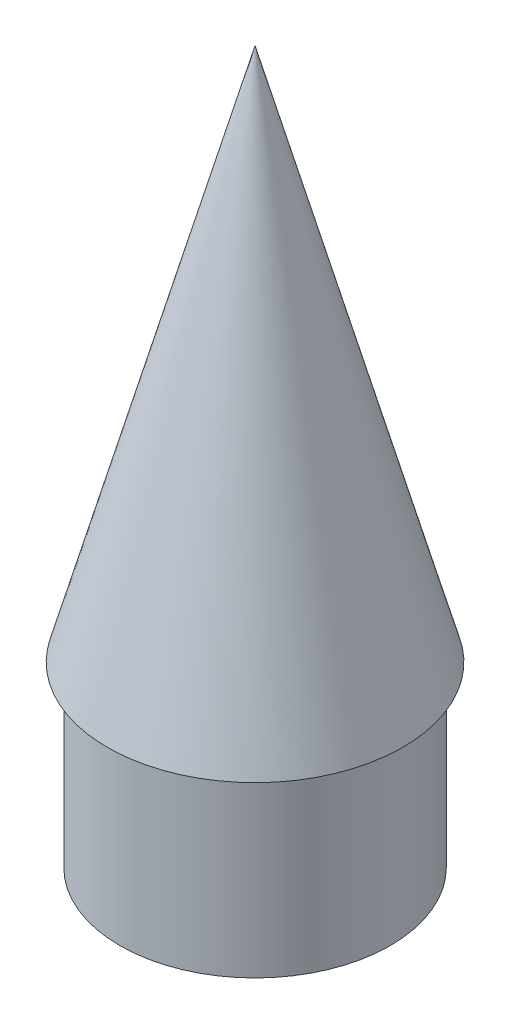
ISO-10303-21;
HEADER;
FILE_DESCRIPTION(('STEP AP214'),'2;1');
FILE_NAME('part.step','',(''),(''),'','','');
FILE_SCHEMA(('AUTOMOTIVE_DESIGN { 1 0 10303 214 1 1 1 1 }'));
ENDSEC;
DATA;
#1=APPLICATION_CONTEXT('core data for automotive mechanical design processes');
#2=APPLICATION_PROTOCOL_DEFINITION('international standard','automotive_design',2000,#1);
#3=PRODUCT_CONTEXT('',#1,'mechanical');
#4=PRODUCT('Part','Part','',(#3));
#5=PRODUCT_RELATED_PRODUCT_CATEGORY('part','',(#4));
#6=PRODUCT_DEFINITION_FORMATION('','',#4);
#7=PRODUCT_DEFINITION_CONTEXT('part definition',#1,'design');
#8=PRODUCT_DEFINITION('design','',#6,#7);
#9=PRODUCT_DEFINITION_SHAPE('','',#8);
#10=(LENGTH_UNIT() NAMED_UNIT(*) SI_UNIT(.MILLI.,.METRE.));
#11=(NAMED_UNIT(*) PLANE_ANGLE_UNIT() SI_UNIT($,.RADIAN.));
#12=(NAMED_UNIT(*) SI_UNIT($,.STERADIAN.) SOLID_ANGLE_UNIT());
#13=UNCERTAINTY_MEASURE_WITH_UNIT(LENGTH_MEASURE(1.E-05),#10,'distance_accuracy_value','');
#14=(GEOMETRIC_REPRESENTATION_CONTEXT(3) GLOBAL_UNCERTAINTY_ASSIGNED_CONTEXT((#13)) GLOBAL_UNIT_ASSIGNED_CONTEXT((#10,
#11,#12)) REPRESENTATION_CONTEXT('',''));
#15=CARTESIAN_POINT('',(0.,0.,0.));
#16=DIRECTION('',(0.,0.,1.));
#17=DIRECTION('',(1.,0.,0.));
#18=AXIS2_PLACEMENT_3D('',#15,#16,#17);
#19=CARTESIAN_POINT('',(0.,150.,0.));
#20=DIRECTION('',(0.,-1.,0.));
#21=DIRECTION('',(0.,0.,-1.));
#22=AXIS2_PLACEMENT_3D('',#19,#20,#21);
#23=CONICAL_SURFACE('',#22,0.,0.26991503643116);
#24=CARTESIAN_POINT('',(0.,0.,0.));
#25=DIRECTION('',(0.,-1.,0.));
#26=DIRECTION('',(0.,0.,-1.));
#27=AXIS2_PLACEMENT_3D('',#24,#25,#26);
#28=CIRCLE('',#27,41.5);
#29=CARTESIAN_POINT('',(0.,0.,-41.5));
#30=VERTEX_POINT('',#29);
#31=EDGE_CURVE('E106',#30,#30,#28,.T.);
#32=CARTESIAN_POINT('',(0.,149.9,0.));
#33=DIRECTION('',(0.,1.,0.));
#34=DIRECTION('',(0.,0.,1.));
#35=AXIS2_PLACEMENT_3D('',#32,#33,#34);
#36=CIRCLE('',#35,0.0276666666666713);
#37=CARTESIAN_POINT('',(0.,149.9,-0.0276666666666751));
#38=VERTEX_POINT('',#37);
#39=EDGE_CURVE('E54',#38,#38,#36,.T.);
#40=CARTESIAN_POINT('',(0.,0.,-41.5));
#41=CARTESIAN_POINT('',(0.,1.56145833333333,-41.0679965277778));
#42=CARTESIAN_POINT('',(0.,3.12291666666666,-40.6359930555556));
#43=CARTESIAN_POINT('',(0.,6.24583333333333,-39.7719861111111));
#44=CARTESIAN_POINT('',(0.,7.80729166666667,-39.3399826388889));
#45=CARTESIAN_POINT('',(0.,10.9302083333333,-38.4759756944444));
#46=CARTESIAN_POINT('',(0.,12.4916666666667,-38.0439722222222));
#47=CARTESIAN_POINT('',(0.,15.6145833333333,-37.1799652777778));
#48=CARTESIAN_POINT('',(0.,17.1760416666667,-36.7479618055556));
#49=CARTESIAN_POINT('',(0.,20.2989583333333,-35.8839548611111));
#50=CARTESIAN_POINT('',(0.,21.8604166666666,-35.4519513888889));
#51=CARTESIAN_POINT('',(0.,24.9833333333333,-34.5879444444444));
#52=CARTESIAN_POINT('',(0.,26.5447916666667,-34.1559409722222));
#53=CARTESIAN_POINT('',(0.,29.6677083333333,-33.2919340277778));
#54=CARTESIAN_POINT('',(0.,31.2291666666667,-32.8599305555556));
#55=CARTESIAN_POINT('',(0.,34.3520833333333,-31.9959236111111));
#56=CARTESIAN_POINT('',(0.,35.9135416666667,-31.5639201388889));
#57=CARTESIAN_POINT('',(0.,39.0364583333333,-30.6999131944444));
#58=CARTESIAN_POINT('',(0.,40.5979166666667,-30.2679097222222));
#59=CARTESIAN_POINT('',(0.,43.7208333333333,-29.4039027777778));
#60=CARTESIAN_POINT('',(0.,45.2822916666667,-28.9718993055556));
#61=CARTESIAN_POINT('',(0.,48.4052083333333,-28.1078923611111));
#62=CARTESIAN_POINT('',(0.,49.9666666666667,-27.6758888888889));
#63=CARTESIAN_POINT('',(0.,53.0895833333333,-26.8118819444444));
#64=CARTESIAN_POINT('',(0.,54.6510416666667,-26.3798784722222));
#65=CARTESIAN_POINT('',(0.,57.7739583333333,-25.5158715277778));
#66=CARTESIAN_POINT('',(0.,59.3354166666667,-25.0838680555556));
#67=CARTESIAN_POINT('',(0.,62.4583333333333,-24.2198611111111));
#68=CARTESIAN_POINT('',(0.,64.0197916666667,-23.7878576388889));
#69=CARTESIAN_POINT('',(0.,67.1427083333333,-22.9238506944445));
#70=CARTESIAN_POINT('',(0.,68.7041666666667,-22.4918472222222));
#71=CARTESIAN_POINT('',(0.,71.8270833333333,-21.6278402777778));
#72=CARTESIAN_POINT('',(0.,73.3885416666667,-21.1958368055556));
#73=CARTESIAN_POINT('',(0.,76.5114583333333,-20.3318298611111));
#74=CARTESIAN_POINT('',(0.,78.0729166666667,-19.8998263888889));
#75=CARTESIAN_POINT('',(0.,81.1958333333333,-19.0358194444444));
#76=CARTESIAN_POINT('',(0.,82.7572916666666,-18.6038159722222));
#77=CARTESIAN_POINT('',(0.,85.8802083333333,-17.7398090277778));
#78=CARTESIAN_POINT('',(0.,87.4416666666666,-17.3078055555556));
#79=CARTESIAN_POINT('',(0.,90.5645833333333,-16.4437986111111));
#80=CARTESIAN_POINT('',(0.,92.1260416666666,-16.0117951388889));
#81=CARTESIAN_POINT('',(0.,95.2489583333333,-15.1477881944445));
#82=CARTESIAN_POINT('',(0.,96.8104166666667,-14.7157847222222));
#83=CARTESIAN_POINT('',(0.,99.9333333333333,-13.8517777777778));
#84=CARTESIAN_POINT('',(0.,101.494791666667,-13.4197743055556));
#85=CARTESIAN_POINT('',(0.,104.617708333333,-12.5557673611111));
#86=CARTESIAN_POINT('',(0.,106.179166666667,-12.1237638888889));
#87=CARTESIAN_POINT('',(0.,109.302083333333,-11.2597569444445));
#88=CARTESIAN_POINT('',(0.,110.863541666667,-10.8277534722222));
#89=CARTESIAN_POINT('',(0.,113.986458333333,-9.96374652777779));
#90=CARTESIAN_POINT('',(0.,115.547916666667,-9.53174305555556));
#91=CARTESIAN_POINT('',(0.,118.670833333333,-8.66773611111112));
#92=CARTESIAN_POINT('',(0.,120.232291666667,-8.2357326388889));
#93=CARTESIAN_POINT('',(0.,123.355208333333,-7.37172569444446));
#94=CARTESIAN_POINT('',(0.,124.916666666667,-6.93972222222224));
#95=CARTESIAN_POINT('',(0.,128.039583333333,-6.07571527777779));
#96=CARTESIAN_POINT('',(0.,129.601041666667,-5.64371180555557));
#97=CARTESIAN_POINT('',(0.,132.723958333333,-4.77970486111112));
#98=CARTESIAN_POINT('',(0.,134.285416666667,-4.3477013888889));
#99=CARTESIAN_POINT('',(0.,137.408333333333,-3.48369444444446));
#100=CARTESIAN_POINT('',(0.,138.969791666667,-3.05169097222224));
#101=CARTESIAN_POINT('',(0.,142.092708333333,-2.18768402777779));
#102=CARTESIAN_POINT('',(0.,143.654166666667,-1.75568055555557));
#103=CARTESIAN_POINT('',(0.,146.777083333333,-0.891673611111122));
#104=CARTESIAN_POINT('',(0.,148.338541666667,-0.4596701388889));
#105=CARTESIAN_POINT('',(0.,149.9,-0.027666666666679));
#106=B_SPLINE_CURVE_WITH_KNOTS('',3,(#40,#41,#42,#43,#44,#45,#46,#47,#48,#49,#50,#51,#52,#53,
#54,#55,#56,#57,#58,#59,#60,#61,#62,#63,#64,#65,#66,#67,#68,#69,#70,#71,#72,#73,#74,#75,#76,#77,
#78,#79,#80,#81,#82,#83,#84,#85,#86,#87,#88,#89,#90,#91,#92,#93,#94,#95,#96,#97,#98,#99,#100,
#101,#102,#103,#104,#105),.UNSPECIFIED.,.F.,.F.,(4,2,2,2,2,2,2,2,2,2,2,2,2,2,2,2,2,2,2,2,2,2,2,
2,2,2,2,2,2,2,2,2,4),(0.,4.86035103060812,9.72070206121627,14.5810530918244,19.4414041224325,
24.3017551530406,29.1621061836488,34.0224572142569,38.882808244865,43.7431592754732,
48.6035103060813,53.4638613366894,58.3242123672975,63.1845633979057,68.0449144285138,
72.9052654591219,77.7656164897301,82.6259675203382,87.4863185509463,92.3466695815545,
97.2070206121626,102.067371642771,106.927722673379,111.788073703987,116.648424734595,
121.508775765203,126.369126795811,131.22947782642,136.089828857028,140.950179887636,
145.810530918244,150.670881948852,155.53123297946),.UNSPECIFIED.);
#107=EDGE_CURVE('BSEAM50',#30,#38,#106,.T.);
#108=ORIENTED_EDGE('',*,*,#31,.F.);
#109=ORIENTED_EDGE('',*,*,#39,.F.);
#110=ORIENTED_EDGE('',*,*,#107,.T.);
#111=ORIENTED_EDGE('',*,*,#107,.F.);
#112=EDGE_LOOP('',(#108,#110,#109,#111));
#113=FACE_BOUND('',#112,.T.);
#114=ADVANCED_FACE('F50',(#113),#23,.T.);
#115=CARTESIAN_POINT('',(-41.5,0.,0.));
#116=DIRECTION('',(0.,1.,0.));
#117=DIRECTION('',(0.,0.,1.));
#118=AXIS2_PLACEMENT_3D('',#115,#116,#117);
#119=PLANE('',#118);
#120=ORIENTED_EDGE('',*,*,#31,.T.);
#121=EDGE_LOOP('',(#120));
#122=FACE_BOUND('',#121,.T.);
#123=CARTESIAN_POINT('',(0.,0.,0.));
#124=DIRECTION('',(0.,1.,0.));
#125=DIRECTION('',(0.,0.,1.));
#126=AXIS2_PLACEMENT_3D('',#123,#124,#125);
#127=CIRCLE('',#126,38.);
#128=CARTESIAN_POINT('',(0.,0.,38.));
#129=VERTEX_POINT('',#128);
#130=EDGE_CURVE('E58',#129,#129,#127,.F.);
#131=ORIENTED_EDGE('',*,*,#130,.F.);
#132=EDGE_LOOP('',(#131));
#133=FACE_BOUND('',#132,.T.);
#134=ADVANCED_FACE('F80',(#122,#133),#119,.F.);
#135=CARTESIAN_POINT('',(0.,0.,0.));
#136=DIRECTION('',(0.,1.,0.));
#137=DIRECTION('',(0.,0.,1.));
#138=AXIS2_PLACEMENT_3D('',#135,#136,#137);
#139=CYLINDRICAL_SURFACE('',#138,38.);
#140=ORIENTED_EDGE('',*,*,#130,.T.);
#141=EDGE_LOOP('',(#140));
#142=FACE_BOUND('',#141,.T.);
#143=CARTESIAN_POINT('',(0.,-50.,0.));
#144=DIRECTION('',(0.,1.,0.));
#145=DIRECTION('',(0.,0.,1.));
#146=AXIS2_PLACEMENT_3D('',#143,#144,#145);
#147=CIRCLE('',#146,38.);
#148=CARTESIAN_POINT('',(0.,-50.,38.));
#149=VERTEX_POINT('',#148);
#150=EDGE_CURVE('E99',#149,#149,#147,.T.);
#151=ORIENTED_EDGE('',*,*,#150,.T.);
#152=EDGE_LOOP('',(#151));
#153=FACE_BOUND('',#152,.T.);
#154=ADVANCED_FACE('F74',(#142,#153),#139,.T.);
#155=CARTESIAN_POINT('',(0.,-50.,0.));
#156=DIRECTION('',(0.,1.,0.));
#157=DIRECTION('',(0.,0.,1.));
#158=AXIS2_PLACEMENT_3D('',#155,#156,#157);
#159=PLANE('',#158);
#160=ORIENTED_EDGE('',*,*,#150,.F.);
#161=EDGE_LOOP('',(#160));
#162=FACE_BOUND('',#161,.T.);
#163=CARTESIAN_POINT('',(0.,-50.,0.));
#164=DIRECTION('',(0.,1.,0.));
#165=DIRECTION('',(0.,0.,1.));
#166=AXIS2_PLACEMENT_3D('',#163,#164,#165);
#167=CIRCLE('',#166,33.);
#168=CARTESIAN_POINT('',(0.,-50.,33.));
#169=VERTEX_POINT('',#168);
#170=EDGE_CURVE('E101',#169,#169,#167,.T.);
#171=ORIENTED_EDGE('',*,*,#170,.T.);
#172=EDGE_LOOP('',(#171));
#173=FACE_BOUND('',#172,.T.);
#174=ADVANCED_FACE('F69',(#162,#173),#159,.F.);
#175=CARTESIAN_POINT('',(0.,2.,0.));
#176=DIRECTION('',(0.,-1.,0.));
#177=DIRECTION('',(0.,0.,-1.));
#178=AXIS2_PLACEMENT_3D('',#175,#176,#177);
#179=CYLINDRICAL_SURFACE('',#178,33.);
#180=ORIENTED_EDGE('',*,*,#170,.F.);
#181=EDGE_LOOP('',(#180));
#182=FACE_BOUND('',#181,.T.);
#183=CARTESIAN_POINT('',(0.,23.222410137869,0.));
#184=DIRECTION('',(0.,-1.,0.));
#185=DIRECTION('',(0.,0.,-1.));
#186=AXIS2_PLACEMENT_3D('',#183,#184,#185);
#187=CIRCLE('',#186,33.);
#188=CARTESIAN_POINT('',(0.,23.222410137869,-33.));
#189=VERTEX_POINT('',#188);
#190=EDGE_CURVE('E11',#189,#189,#187,.F.);
#191=ORIENTED_EDGE('',*,*,#190,.T.);
#192=EDGE_LOOP('',(#191));
#193=FACE_BOUND('',#192,.T.);
#194=ADVANCED_FACE('F65',(#182,#193),#179,.F.);
#195=CARTESIAN_POINT('',(0.,2.,0.));
#196=DIRECTION('',(0.,-1.,0.));
#197=DIRECTION('',(0.,0.,-1.));
#198=AXIS2_PLACEMENT_3D('',#195,#196,#197);
#199=CONICAL_SURFACE('',#198,38.8715334714771,0.26991503643116);
#200=CARTESIAN_POINT('',(0.,142.499518571604,0.));
#201=VERTEX_POINT('',#200);
#202=VERTEX_LOOP('',#201);
#203=FACE_BOUND('',#202,.T.);
#204=ORIENTED_EDGE('',*,*,#190,.F.);
#205=EDGE_LOOP('',(#204));
#206=FACE_BOUND('',#205,.T.);
#207=ADVANCED_FACE('F52',(#203,#206),#199,.F.);
#208=CARTESIAN_POINT('',(0.,149.9,0.));
#209=DIRECTION('',(0.,1.,0.));
#210=DIRECTION('',(0.,0.,1.));
#211=AXIS2_PLACEMENT_3D('',#208,#209,#210);
#212=PLANE('',#211);
#213=ORIENTED_EDGE('',*,*,#39,.T.);
#214=EDGE_LOOP('',(#213));
#215=FACE_BOUND('',#214,.T.);
#216=ADVANCED_FACE('F64',(#215),#212,.T.);
#217=CLOSED_SHELL('',(#114,#134,#154,#174,#194,#207,#216));
#218=MANIFOLD_SOLID_BREP('B2',#217);
#219=ADVANCED_BREP_SHAPE_REPRESENTATION('',(#18,#218),#14);
#220=SHAPE_DEFINITION_REPRESENTATION(#9,#219);
ENDSEC;
END-ISO-10303-21;
